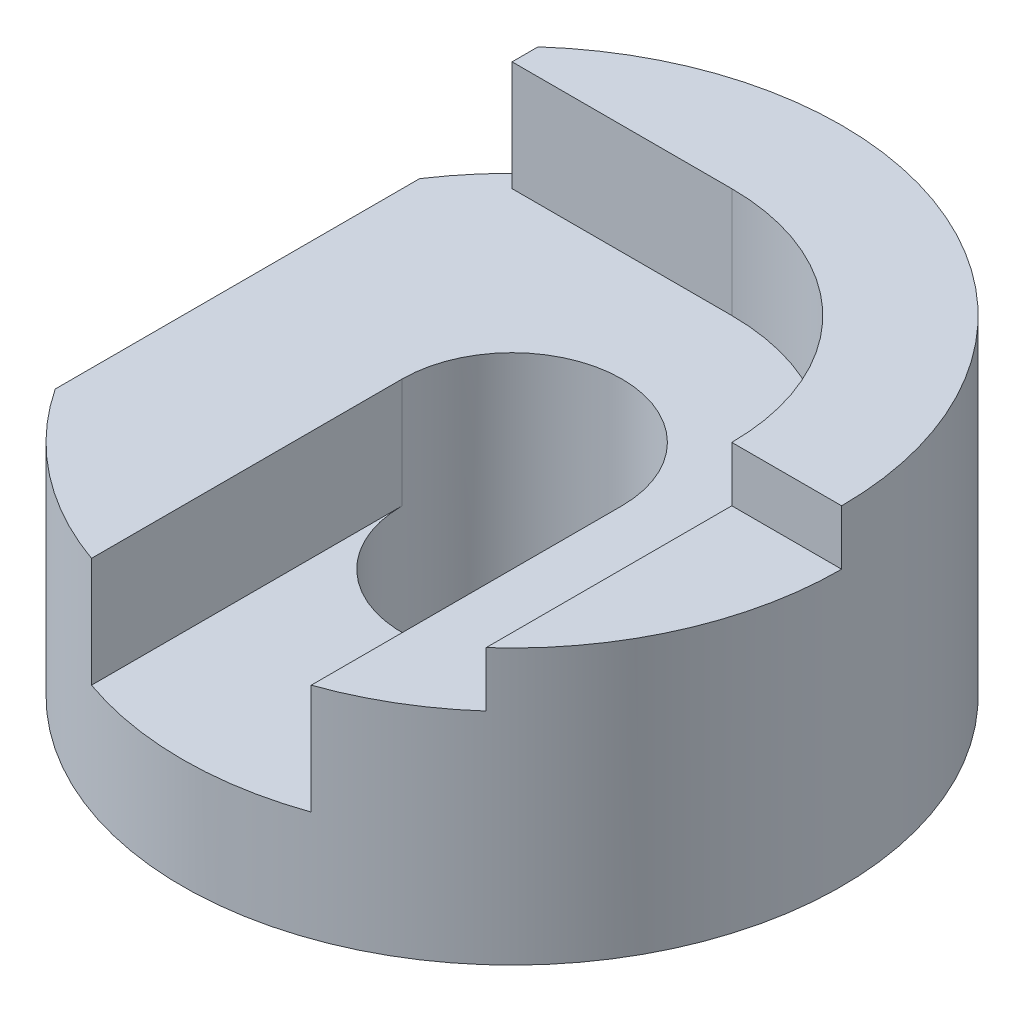
ISO-10303-21;
HEADER;
FILE_DESCRIPTION(('STEP AP214'),'2;1');
FILE_NAME('part.step','',(''),(''),'','','');
FILE_SCHEMA(('AUTOMOTIVE_DESIGN { 1 0 10303 214 1 1 1 1 }'));
ENDSEC;
DATA;
#1=APPLICATION_CONTEXT('core data for automotive mechanical design processes');
#2=APPLICATION_PROTOCOL_DEFINITION('international standard','automotive_design',2000,#1);
#3=PRODUCT_CONTEXT('',#1,'mechanical');
#4=PRODUCT('Part','Part','',(#3));
#5=PRODUCT_RELATED_PRODUCT_CATEGORY('part','',(#4));
#6=PRODUCT_DEFINITION_FORMATION('','',#4);
#7=PRODUCT_DEFINITION_CONTEXT('part definition',#1,'design');
#8=PRODUCT_DEFINITION('design','',#6,#7);
#9=PRODUCT_DEFINITION_SHAPE('','',#8);
#10=(LENGTH_UNIT() NAMED_UNIT(*) SI_UNIT(.MILLI.,.METRE.));
#11=(NAMED_UNIT(*) PLANE_ANGLE_UNIT() SI_UNIT($,.RADIAN.));
#12=(NAMED_UNIT(*) SI_UNIT($,.STERADIAN.) SOLID_ANGLE_UNIT());
#13=UNCERTAINTY_MEASURE_WITH_UNIT(LENGTH_MEASURE(1.E-05),#10,'distance_accuracy_value','');
#14=(GEOMETRIC_REPRESENTATION_CONTEXT(3) GLOBAL_UNCERTAINTY_ASSIGNED_CONTEXT((#13)) GLOBAL_UNIT_ASSIGNED_CONTEXT((#10,
#11,#12)) REPRESENTATION_CONTEXT('',''));
#15=CARTESIAN_POINT('',(0.,0.,0.));
#16=DIRECTION('',(0.,0.,1.));
#17=DIRECTION('',(1.,0.,0.));
#18=AXIS2_PLACEMENT_3D('',#15,#16,#17);
#19=CARTESIAN_POINT('',(0.,60.,120.));
#20=DIRECTION('',(0.,-1.,0.));
#21=DIRECTION('',(0.,0.,-1.));
#22=AXIS2_PLACEMENT_3D('',#19,#20,#21);
#23=PLANE('',#22);
#24=CARTESIAN_POINT('',(60.,60.,60.));
#25=DIRECTION('',(0.,1.,0.));
#26=DIRECTION('',(0.,0.,1.));
#27=AXIS2_PLACEMENT_3D('',#24,#25,#26);
#28=CIRCLE('',#27,40.);
#29=CARTESIAN_POINT('',(100.,60.,60.));
#30=VERTEX_POINT('',#29);
#31=CARTESIAN_POINT('',(60.,60.,20.));
#32=VERTEX_POINT('',#31);
#33=EDGE_CURVE('E210',#30,#32,#28,.T.);
#34=ORIENTED_EDGE('',*,*,#33,.F.);
#35=DIRECTION('',(-1.,0.,0.));
#36=VECTOR('',#35,1.);
#37=CARTESIAN_POINT('',(120.,60.,60.));
#38=LINE('',#37,#36);
#39=CARTESIAN_POINT('',(120.,60.,60.));
#40=VERTEX_POINT('',#39);
#41=EDGE_CURVE('E202',#40,#30,#38,.T.);
#42=ORIENTED_EDGE('',*,*,#41,.F.);
#43=CARTESIAN_POINT('',(60.,60.,60.));
#44=DIRECTION('',(0.,-1.,0.));
#45=DIRECTION('',(0.,0.,-1.));
#46=AXIS2_PLACEMENT_3D('',#43,#44,#45);
#47=CIRCLE('',#46,60.);
#48=CARTESIAN_POINT('',(20.,60.,15.2786404500042));
#49=VERTEX_POINT('',#48);
#50=EDGE_CURVE('E249',#49,#40,#47,.T.);
#51=ORIENTED_EDGE('',*,*,#50,.F.);
#52=DIRECTION('',(0.,0.,1.));
#53=VECTOR('',#52,1.);
#54=CARTESIAN_POINT('',(20.,60.,0.));
#55=LINE('',#54,#53);
#56=CARTESIAN_POINT('',(20.,60.,20.));
#57=VERTEX_POINT('',#56);
#58=EDGE_CURVE('E255',#49,#57,#55,.T.);
#59=ORIENTED_EDGE('',*,*,#58,.T.);
#60=DIRECTION('',(-1.,0.,0.));
#61=VECTOR('',#60,1.);
#62=CARTESIAN_POINT('',(0.,60.,20.));
#63=LINE('',#62,#61);
#64=EDGE_CURVE('E215',#32,#57,#63,.T.);
#65=ORIENTED_EDGE('',*,*,#64,.F.);
#66=EDGE_LOOP('',(#34,#42,#51,#59,#65));
#67=FACE_BOUND('',#66,.T.);
#68=ADVANCED_FACE('F69',(#67),#23,.F.);
#69=CARTESIAN_POINT('',(60.,120.,60.));
#70=DIRECTION('',(0.,-1.,0.));
#71=DIRECTION('',(0.,0.,-1.));
#72=AXIS2_PLACEMENT_3D('',#69,#70,#71);
#73=CYLINDRICAL_SURFACE('',#72,60.);
#74=DIRECTION('',(0.,1.,0.));
#75=VECTOR('',#74,1.);
#76=CARTESIAN_POINT('',(80.0000000000001,20.,116.568542494924));
#77=LINE('',#76,#75);
#78=CARTESIAN_POINT('',(80.0000000000001,20.,116.568542494924));
#79=VERTEX_POINT('',#78);
#80=CARTESIAN_POINT('',(80.0000000000001,40.,116.568542494924));
#81=VERTEX_POINT('',#80);
#82=EDGE_CURVE('E189',#79,#81,#77,.T.);
#83=ORIENTED_EDGE('',*,*,#82,.F.);
#84=CARTESIAN_POINT('',(60.,20.,60.));
#85=DIRECTION('',(0.,1.,0.));
#86=DIRECTION('',(0.,0.,1.));
#87=AXIS2_PLACEMENT_3D('',#84,#85,#86);
#88=CIRCLE('',#87,60.);
#89=CARTESIAN_POINT('',(40.,20.,116.568542494924));
#90=VERTEX_POINT('',#89);
#91=EDGE_CURVE('E172',#90,#79,#88,.T.);
#92=ORIENTED_EDGE('',*,*,#91,.F.);
#93=DIRECTION('',(0.,1.,0.));
#94=VECTOR('',#93,1.);
#95=CARTESIAN_POINT('',(40.,20.,116.568542494924));
#96=LINE('',#95,#94);
#97=CARTESIAN_POINT('',(40.,40.,116.568542494924));
#98=VERTEX_POINT('',#97);
#99=EDGE_CURVE('E169',#90,#98,#96,.T.);
#100=ORIENTED_EDGE('',*,*,#99,.T.);
#101=CARTESIAN_POINT('',(60.,40.,60.));
#102=DIRECTION('',(0.,-1.,0.));
#103=DIRECTION('',(0.,0.,-1.));
#104=AXIS2_PLACEMENT_3D('',#101,#102,#103);
#105=CIRCLE('',#104,60.);
#106=CARTESIAN_POINT('',(10.,40.,93.166247903554));
#107=VERTEX_POINT('',#106);
#108=EDGE_CURVE('E91',#98,#107,#105,.T.);
#109=ORIENTED_EDGE('',*,*,#108,.T.);
#110=DIRECTION('',(0.,-1.,0.));
#111=VECTOR('',#110,1.);
#112=CARTESIAN_POINT('',(10.,120.,93.166247903554));
#113=LINE('',#112,#111);
#114=CARTESIAN_POINT('',(10.,30.,93.166247903554));
#115=VERTEX_POINT('',#114);
#116=EDGE_CURVE('E247',#107,#115,#113,.T.);
#117=ORIENTED_EDGE('',*,*,#116,.T.);
#118=CARTESIAN_POINT('',(60.,30.,60.));
#119=DIRECTION('',(0.,-1.,0.));
#120=DIRECTION('',(0.,0.,-1.));
#121=AXIS2_PLACEMENT_3D('',#118,#119,#120);
#122=CIRCLE('',#121,60.);
#123=CARTESIAN_POINT('',(10.,30.,26.833752096446));
#124=VERTEX_POINT('',#123);
#125=EDGE_CURVE('E252',#115,#124,#122,.T.);
#126=ORIENTED_EDGE('',*,*,#125,.T.);
#127=DIRECTION('',(0.,-1.,0.));
#128=VECTOR('',#127,1.);
#129=CARTESIAN_POINT('',(10.,120.,26.833752096446));
#130=LINE('',#129,#128);
#131=CARTESIAN_POINT('',(10.,40.,26.833752096446));
#132=VERTEX_POINT('',#131);
#133=EDGE_CURVE('E242',#124,#132,#130,.F.);
#134=ORIENTED_EDGE('',*,*,#133,.T.);
#135=CARTESIAN_POINT('',(60.,40.,60.));
#136=DIRECTION('',(0.,-1.,0.));
#137=DIRECTION('',(0.,0.,-1.));
#138=AXIS2_PLACEMENT_3D('',#135,#136,#137);
#139=CIRCLE('',#138,60.);
#140=CARTESIAN_POINT('',(20.,40.,15.2786404500042));
#141=VERTEX_POINT('',#140);
#142=EDGE_CURVE('E12',#132,#141,#139,.T.);
#143=ORIENTED_EDGE('',*,*,#142,.T.);
#144=DIRECTION('',(0.,-1.,0.));
#145=VECTOR('',#144,1.);
#146=CARTESIAN_POINT('',(20.,120.,15.2786404500042));
#147=LINE('',#146,#145);
#148=EDGE_CURVE('E239',#141,#49,#147,.F.);
#149=ORIENTED_EDGE('',*,*,#148,.T.);
#150=ORIENTED_EDGE('',*,*,#50,.T.);
#151=DIRECTION('',(0.,-1.,0.));
#152=VECTOR('',#151,1.);
#153=CARTESIAN_POINT('',(120.,60.,60.));
#154=LINE('',#153,#152);
#155=CARTESIAN_POINT('',(120.,50.,60.));
#156=VERTEX_POINT('',#155);
#157=EDGE_CURVE('E194',#40,#156,#154,.T.);
#158=ORIENTED_EDGE('',*,*,#157,.T.);
#159=CARTESIAN_POINT('',(60.,50.,60.));
#160=DIRECTION('',(0.,-1.,0.));
#161=DIRECTION('',(0.,0.,-1.));
#162=AXIS2_PLACEMENT_3D('',#159,#160,#161);
#163=CIRCLE('',#162,60.);
#164=CARTESIAN_POINT('',(100.,50.,104.721359549996));
#165=VERTEX_POINT('',#164);
#166=EDGE_CURVE('E208',#165,#156,#163,.F.);
#167=ORIENTED_EDGE('',*,*,#166,.F.);
#168=DIRECTION('',(0.,1.,0.));
#169=VECTOR('',#168,1.);
#170=CARTESIAN_POINT('',(100.,40.,104.721359549996));
#171=LINE('',#170,#169);
#172=CARTESIAN_POINT('',(100.,40.,104.721359549996));
#173=VERTEX_POINT('',#172);
#174=EDGE_CURVE('E225',#173,#165,#171,.T.);
#175=ORIENTED_EDGE('',*,*,#174,.F.);
#176=EDGE_CURVE('E77',#173,#81,#105,.T.);
#177=ORIENTED_EDGE('',*,*,#176,.T.);
#178=EDGE_LOOP('',(#83,#92,#100,#109,#117,#126,#134,#143,#149,#150,#158,#167,#175,#177));
#179=FACE_BOUND('',#178,.T.);
#180=CARTESIAN_POINT('',(60.,0.,60.));
#181=DIRECTION('',(0.,-1.,0.));
#182=DIRECTION('',(0.,0.,-1.));
#183=AXIS2_PLACEMENT_3D('',#180,#181,#182);
#184=CIRCLE('',#183,60.);
#185=CARTESIAN_POINT('',(60.,0.,0.));
#186=VERTEX_POINT('',#185);
#187=EDGE_CURVE('E244',#186,#186,#184,.T.);
#188=ORIENTED_EDGE('',*,*,#187,.F.);
#189=EDGE_LOOP('',(#188));
#190=FACE_BOUND('',#189,.T.);
#191=ADVANCED_FACE('F265',(#179,#190),#73,.T.);
#192=CARTESIAN_POINT('',(60.,120.,60.));
#193=DIRECTION('',(0.,-1.,0.));
#194=DIRECTION('',(0.,0.,-1.));
#195=AXIS2_PLACEMENT_3D('',#192,#193,#194);
#196=CYLINDRICAL_SURFACE('',#195,20.);
#197=CARTESIAN_POINT('',(60.,20.,60.));
#198=DIRECTION('',(0.,-1.,0.));
#199=DIRECTION('',(0.,0.,1.));
#200=AXIS2_PLACEMENT_3D('',#197,#198,#199);
#201=CIRCLE('',#200,20.);
#202=CARTESIAN_POINT('',(80.,20.,60.));
#203=VERTEX_POINT('',#202);
#204=CARTESIAN_POINT('',(40.,20.,60.));
#205=VERTEX_POINT('',#204);
#206=EDGE_CURVE('E173',#203,#205,#201,.T.);
#207=ORIENTED_EDGE('',*,*,#206,.F.);
#208=DIRECTION('',(0.,1.,0.));
#209=VECTOR('',#208,1.);
#210=CARTESIAN_POINT('',(80.,20.,60.));
#211=LINE('',#210,#209);
#212=CARTESIAN_POINT('',(80.,40.,60.));
#213=VERTEX_POINT('',#212);
#214=EDGE_CURVE('E201',#203,#213,#211,.T.);
#215=ORIENTED_EDGE('',*,*,#214,.T.);
#216=CARTESIAN_POINT('',(60.,40.,60.));
#217=DIRECTION('',(0.,-1.,0.));
#218=DIRECTION('',(0.,0.,1.));
#219=AXIS2_PLACEMENT_3D('',#216,#217,#218);
#220=CIRCLE('',#219,20.);
#221=CARTESIAN_POINT('',(40.,40.,60.));
#222=VERTEX_POINT('',#221);
#223=EDGE_CURVE('E187',#222,#213,#220,.T.);
#224=ORIENTED_EDGE('',*,*,#223,.F.);
#225=DIRECTION('',(0.,1.,0.));
#226=VECTOR('',#225,1.);
#227=CARTESIAN_POINT('',(40.,20.,60.));
#228=LINE('',#227,#226);
#229=EDGE_CURVE('E167',#205,#222,#228,.T.);
#230=ORIENTED_EDGE('',*,*,#229,.F.);
#231=EDGE_LOOP('',(#207,#215,#224,#230));
#232=FACE_BOUND('',#231,.T.);
#233=CARTESIAN_POINT('',(60.,0.,60.));
#234=DIRECTION('',(0.,-1.,0.));
#235=DIRECTION('',(0.,0.,-1.));
#236=AXIS2_PLACEMENT_3D('',#233,#234,#235);
#237=CIRCLE('',#236,20.);
#238=CARTESIAN_POINT('',(60.,0.,40.));
#239=VERTEX_POINT('',#238);
#240=EDGE_CURVE('E236',#239,#239,#237,.T.);
#241=ORIENTED_EDGE('',*,*,#240,.T.);
#242=EDGE_LOOP('',(#241));
#243=FACE_BOUND('',#242,.T.);
#244=ADVANCED_FACE('F184',(#232,#243),#196,.F.);
#245=CARTESIAN_POINT('',(0.,0.,120.));
#246=DIRECTION('',(0.,1.,0.));
#247=DIRECTION('',(0.,0.,1.));
#248=AXIS2_PLACEMENT_3D('',#245,#246,#247);
#249=PLANE('',#248);
#250=ORIENTED_EDGE('',*,*,#240,.F.);
#251=EDGE_LOOP('',(#250));
#252=FACE_BOUND('',#251,.T.);
#253=ORIENTED_EDGE('',*,*,#187,.T.);
#254=EDGE_LOOP('',(#253));
#255=FACE_BOUND('',#254,.T.);
#256=ADVANCED_FACE('F71',(#252,#255),#249,.F.);
#257=CARTESIAN_POINT('',(10.,60.,0.));
#258=DIRECTION('',(1.,0.,0.));
#259=DIRECTION('',(0.,1.,0.));
#260=AXIS2_PLACEMENT_3D('',#257,#258,#259);
#261=PLANE('',#260);
#262=ORIENTED_EDGE('',*,*,#133,.F.);
#263=DIRECTION('',(0.,0.,1.));
#264=VECTOR('',#263,1.);
#265=CARTESIAN_POINT('',(10.,30.,0.));
#266=LINE('',#265,#264);
#267=EDGE_CURVE('E84',#124,#115,#266,.T.);
#268=ORIENTED_EDGE('',*,*,#267,.T.);
#269=ORIENTED_EDGE('',*,*,#116,.F.);
#270=DIRECTION('',(0.,0.,1.));
#271=VECTOR('',#270,1.);
#272=CARTESIAN_POINT('',(10.,40.,0.));
#273=LINE('',#272,#271);
#274=EDGE_CURVE('E254',#132,#107,#273,.T.);
#275=ORIENTED_EDGE('',*,*,#274,.F.);
#276=EDGE_LOOP('',(#262,#268,#269,#275));
#277=FACE_BOUND('',#276,.T.);
#278=ADVANCED_FACE('F288',(#277),#261,.F.);
#279=CARTESIAN_POINT('',(0.,30.,0.));
#280=DIRECTION('',(0.,-1.,0.));
#281=DIRECTION('',(0.,0.,-1.));
#282=AXIS2_PLACEMENT_3D('',#279,#280,#281);
#283=PLANE('',#282);
#284=ORIENTED_EDGE('',*,*,#267,.F.);
#285=ORIENTED_EDGE('',*,*,#125,.F.);
#286=EDGE_LOOP('',(#284,#285));
#287=FACE_BOUND('',#286,.T.);
#288=ADVANCED_FACE('F291',(#287),#283,.F.);
#289=CARTESIAN_POINT('',(20.,60.,0.));
#290=DIRECTION('',(1.,0.,0.));
#291=DIRECTION('',(0.,0.,-1.));
#292=AXIS2_PLACEMENT_3D('',#289,#290,#291);
#293=PLANE('',#292);
#294=DIRECTION('',(0.,0.,1.));
#295=VECTOR('',#294,1.);
#296=CARTESIAN_POINT('',(20.,40.,0.));
#297=LINE('',#296,#295);
#298=CARTESIAN_POINT('',(20.,40.,20.));
#299=VERTEX_POINT('',#298);
#300=EDGE_CURVE('E258',#141,#299,#297,.T.);
#301=ORIENTED_EDGE('',*,*,#300,.T.);
#302=DIRECTION('',(0.,1.,0.));
#303=VECTOR('',#302,1.);
#304=CARTESIAN_POINT('',(20.,40.,20.));
#305=LINE('',#304,#303);
#306=EDGE_CURVE('E228',#299,#57,#305,.T.);
#307=ORIENTED_EDGE('',*,*,#306,.T.);
#308=ORIENTED_EDGE('',*,*,#58,.F.);
#309=ORIENTED_EDGE('',*,*,#148,.F.);
#310=EDGE_LOOP('',(#301,#307,#308,#309));
#311=FACE_BOUND('',#310,.T.);
#312=ADVANCED_FACE('F285',(#311),#293,.F.);
#313=CARTESIAN_POINT('',(10.,40.,0.));
#314=DIRECTION('',(0.,-1.,0.));
#315=DIRECTION('',(0.,0.,-1.));
#316=AXIS2_PLACEMENT_3D('',#313,#314,#315);
#317=PLANE('',#316);
#318=DIRECTION('',(0.,0.,1.));
#319=VECTOR('',#318,1.);
#320=CARTESIAN_POINT('',(40.,40.,60.));
#321=LINE('',#320,#319);
#322=EDGE_CURVE('E460',#222,#98,#321,.T.);
#323=ORIENTED_EDGE('',*,*,#322,.F.);
#324=ORIENTED_EDGE('',*,*,#223,.T.);
#325=DIRECTION('',(0.,0.,-1.));
#326=VECTOR('',#325,1.);
#327=CARTESIAN_POINT('',(80.,40.,60.));
#328=LINE('',#327,#326);
#329=EDGE_CURVE('E182',#81,#213,#328,.T.);
#330=ORIENTED_EDGE('',*,*,#329,.F.);
#331=ORIENTED_EDGE('',*,*,#176,.F.);
#332=DIRECTION('',(0.,0.,1.));
#333=VECTOR('',#332,1.);
#334=CARTESIAN_POINT('',(100.,40.,0.));
#335=LINE('',#334,#333);
#336=CARTESIAN_POINT('',(100.,40.,60.));
#337=VERTEX_POINT('',#336);
#338=EDGE_CURVE('E211',#337,#173,#335,.T.);
#339=ORIENTED_EDGE('',*,*,#338,.F.);
#340=CARTESIAN_POINT('',(60.,40.,60.));
#341=DIRECTION('',(0.,1.,0.));
#342=DIRECTION('',(0.,0.,1.));
#343=AXIS2_PLACEMENT_3D('',#340,#341,#342);
#344=CIRCLE('',#343,40.);
#345=CARTESIAN_POINT('',(60.,40.,20.));
#346=VERTEX_POINT('',#345);
#347=EDGE_CURVE('E214',#337,#346,#344,.T.);
#348=ORIENTED_EDGE('',*,*,#347,.T.);
#349=DIRECTION('',(-1.,0.,0.));
#350=VECTOR('',#349,1.);
#351=CARTESIAN_POINT('',(0.,40.,20.));
#352=LINE('',#351,#350);
#353=EDGE_CURVE('E218',#346,#299,#352,.T.);
#354=ORIENTED_EDGE('',*,*,#353,.T.);
#355=ORIENTED_EDGE('',*,*,#300,.F.);
#356=ORIENTED_EDGE('',*,*,#142,.F.);
#357=ORIENTED_EDGE('',*,*,#274,.T.);
#358=ORIENTED_EDGE('',*,*,#108,.F.);
#359=EDGE_LOOP('',(#323,#324,#330,#331,#339,#348,#354,#355,#356,#357,#358));
#360=FACE_BOUND('',#359,.T.);
#361=ADVANCED_FACE('F271',(#360),#317,.F.);
#362=CARTESIAN_POINT('',(100.,40.,0.));
#363=DIRECTION('',(-1.,0.,0.));
#364=DIRECTION('',(0.,0.,1.));
#365=AXIS2_PLACEMENT_3D('',#362,#363,#364);
#366=PLANE('',#365);
#367=DIRECTION('',(0.,0.,1.));
#368=VECTOR('',#367,1.);
#369=CARTESIAN_POINT('',(100.,50.,104.721359549996));
#370=LINE('',#369,#368);
#371=CARTESIAN_POINT('',(100.,50.,60.));
#372=VERTEX_POINT('',#371);
#373=EDGE_CURVE('E204',#372,#165,#370,.T.);
#374=ORIENTED_EDGE('',*,*,#373,.F.);
#375=DIRECTION('',(0.,1.,0.));
#376=VECTOR('',#375,1.);
#377=CARTESIAN_POINT('',(100.,40.,60.));
#378=LINE('',#377,#376);
#379=EDGE_CURVE('E221',#337,#372,#378,.T.);
#380=ORIENTED_EDGE('',*,*,#379,.F.);
#381=ORIENTED_EDGE('',*,*,#338,.T.);
#382=ORIENTED_EDGE('',*,*,#174,.T.);
#383=EDGE_LOOP('',(#374,#380,#381,#382));
#384=FACE_BOUND('',#383,.T.);
#385=ADVANCED_FACE('F274',(#384),#366,.T.);
#386=CARTESIAN_POINT('',(0.,40.,20.));
#387=DIRECTION('',(0.,0.,-1.));
#388=DIRECTION('',(-1.,0.,0.));
#389=AXIS2_PLACEMENT_3D('',#386,#387,#388);
#390=PLANE('',#389);
#391=ORIENTED_EDGE('',*,*,#64,.T.);
#392=ORIENTED_EDGE('',*,*,#306,.F.);
#393=ORIENTED_EDGE('',*,*,#353,.F.);
#394=DIRECTION('',(0.,1.,0.));
#395=VECTOR('',#394,1.);
#396=CARTESIAN_POINT('',(60.,40.,20.));
#397=LINE('',#396,#395);
#398=EDGE_CURVE('E231',#346,#32,#397,.T.);
#399=ORIENTED_EDGE('',*,*,#398,.T.);
#400=EDGE_LOOP('',(#391,#392,#393,#399));
#401=FACE_BOUND('',#400,.T.);
#402=ADVANCED_FACE('F308',(#401),#390,.F.);
#403=CARTESIAN_POINT('',(60.,40.,60.));
#404=DIRECTION('',(0.,1.,0.));
#405=DIRECTION('',(0.,0.,1.));
#406=AXIS2_PLACEMENT_3D('',#403,#404,#405);
#407=CYLINDRICAL_SURFACE('',#406,40.);
#408=ORIENTED_EDGE('',*,*,#33,.T.);
#409=ORIENTED_EDGE('',*,*,#398,.F.);
#410=ORIENTED_EDGE('',*,*,#347,.F.);
#411=ORIENTED_EDGE('',*,*,#379,.T.);
#412=DIRECTION('',(0.,-1.,0.));
#413=VECTOR('',#412,1.);
#414=CARTESIAN_POINT('',(100.,60.,60.));
#415=LINE('',#414,#413);
#416=EDGE_CURVE('E198',#30,#372,#415,.T.);
#417=ORIENTED_EDGE('',*,*,#416,.F.);
#418=EDGE_LOOP('',(#408,#409,#410,#411,#417));
#419=FACE_BOUND('',#418,.T.);
#420=ADVANCED_FACE('F277',(#419),#407,.F.);
#421=CARTESIAN_POINT('',(120.,50.,104.721359549996));
#422=DIRECTION('',(0.,-1.,0.));
#423=DIRECTION('',(0.,0.,-1.));
#424=AXIS2_PLACEMENT_3D('',#421,#422,#423);
#425=PLANE('',#424);
#426=ORIENTED_EDGE('',*,*,#166,.T.);
#427=DIRECTION('',(-1.,0.,0.));
#428=VECTOR('',#427,1.);
#429=CARTESIAN_POINT('',(120.,50.,60.));
#430=LINE('',#429,#428);
#431=EDGE_CURVE('E197',#156,#372,#430,.T.);
#432=ORIENTED_EDGE('',*,*,#431,.T.);
#433=ORIENTED_EDGE('',*,*,#373,.T.);
#434=EDGE_LOOP('',(#426,#432,#433));
#435=FACE_BOUND('',#434,.T.);
#436=ADVANCED_FACE('F315',(#435),#425,.F.);
#437=CARTESIAN_POINT('',(120.,60.,60.));
#438=DIRECTION('',(0.,0.,-1.));
#439=DIRECTION('',(-1.,0.,0.));
#440=AXIS2_PLACEMENT_3D('',#437,#438,#439);
#441=PLANE('',#440);
#442=ORIENTED_EDGE('',*,*,#416,.T.);
#443=ORIENTED_EDGE('',*,*,#431,.F.);
#444=ORIENTED_EDGE('',*,*,#157,.F.);
#445=ORIENTED_EDGE('',*,*,#41,.T.);
#446=EDGE_LOOP('',(#442,#443,#444,#445));
#447=FACE_BOUND('',#446,.T.);
#448=ADVANCED_FACE('F354',(#447),#441,.F.);
#449=CARTESIAN_POINT('',(80.,20.,60.));
#450=DIRECTION('',(1.,0.,0.));
#451=DIRECTION('',(0.,0.,-1.));
#452=AXIS2_PLACEMENT_3D('',#449,#450,#451);
#453=PLANE('',#452);
#454=ORIENTED_EDGE('',*,*,#329,.T.);
#455=ORIENTED_EDGE('',*,*,#214,.F.);
#456=DIRECTION('',(0.,0.,-1.));
#457=VECTOR('',#456,1.);
#458=CARTESIAN_POINT('',(80.,20.,60.));
#459=LINE('',#458,#457);
#460=EDGE_CURVE('E179',#79,#203,#459,.T.);
#461=ORIENTED_EDGE('',*,*,#460,.F.);
#462=ORIENTED_EDGE('',*,*,#82,.T.);
#463=EDGE_LOOP('',(#454,#455,#461,#462));
#464=FACE_BOUND('',#463,.T.);
#465=ADVANCED_FACE('F363',(#464),#453,.F.);
#466=CARTESIAN_POINT('',(40.,20.,60.));
#467=DIRECTION('',(-1.,0.,0.));
#468=DIRECTION('',(0.,0.,1.));
#469=AXIS2_PLACEMENT_3D('',#466,#467,#468);
#470=PLANE('',#469);
#471=DIRECTION('',(0.,0.,1.));
#472=VECTOR('',#471,1.);
#473=CARTESIAN_POINT('',(40.,20.,60.));
#474=LINE('',#473,#472);
#475=EDGE_CURVE('E163',#205,#90,#474,.T.);
#476=ORIENTED_EDGE('',*,*,#475,.F.);
#477=ORIENTED_EDGE('',*,*,#229,.T.);
#478=ORIENTED_EDGE('',*,*,#322,.T.);
#479=ORIENTED_EDGE('',*,*,#99,.F.);
#480=EDGE_LOOP('',(#476,#477,#478,#479));
#481=FACE_BOUND('',#480,.T.);
#482=ADVANCED_FACE('F165',(#481),#470,.F.);
#483=CARTESIAN_POINT('',(60.,20.,60.));
#484=DIRECTION('',(0.,1.,0.));
#485=DIRECTION('',(0.,0.,1.));
#486=AXIS2_PLACEMENT_3D('',#483,#484,#485);
#487=PLANE('',#486);
#488=ORIENTED_EDGE('',*,*,#206,.T.);
#489=ORIENTED_EDGE('',*,*,#475,.T.);
#490=ORIENTED_EDGE('',*,*,#91,.T.);
#491=ORIENTED_EDGE('',*,*,#460,.T.);
#492=EDGE_LOOP('',(#488,#489,#490,#491));
#493=FACE_BOUND('',#492,.T.);
#494=ADVANCED_FACE('F177',(#493),#487,.T.);
#495=CLOSED_SHELL('',(#68,#191,#244,#256,#278,#288,#312,#361,#385,#402,#420,#436,#448,#465,#482,#494));
#496=MANIFOLD_SOLID_BREP('B2',#495);
#497=ADVANCED_BREP_SHAPE_REPRESENTATION('',(#18,#496),#14);
#498=SHAPE_DEFINITION_REPRESENTATION(#9,#497);
ENDSEC;
END-ISO-10303-21;
